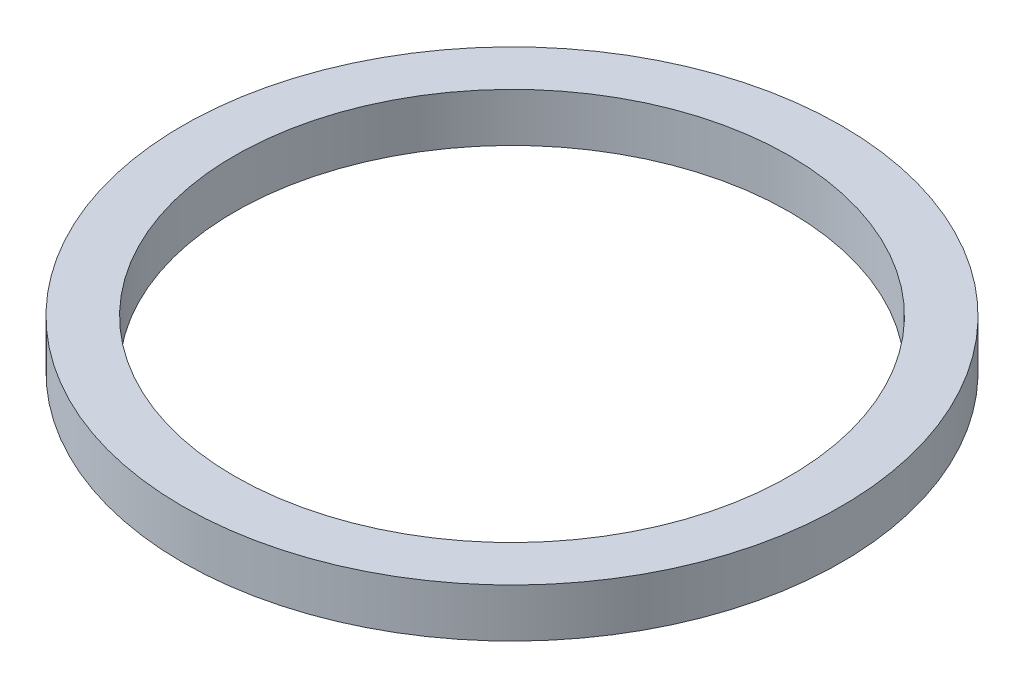
ISO-10303-21;
HEADER;
FILE_DESCRIPTION(('STEP AP214'),'2;1');
FILE_NAME('part.step','',(''),(''),'','','');
FILE_SCHEMA(('AUTOMOTIVE_DESIGN { 1 0 10303 214 1 1 1 1 }'));
ENDSEC;
DATA;
#1=APPLICATION_CONTEXT('core data for automotive mechanical design processes');
#2=APPLICATION_PROTOCOL_DEFINITION('international standard','automotive_design',2000,#1);
#3=PRODUCT_CONTEXT('',#1,'mechanical');
#4=PRODUCT('Part','Part','',(#3));
#5=PRODUCT_RELATED_PRODUCT_CATEGORY('part','',(#4));
#6=PRODUCT_DEFINITION_FORMATION('','',#4);
#7=PRODUCT_DEFINITION_CONTEXT('part definition',#1,'design');
#8=PRODUCT_DEFINITION('design','',#6,#7);
#9=PRODUCT_DEFINITION_SHAPE('','',#8);
#10=(LENGTH_UNIT() NAMED_UNIT(*) SI_UNIT(.MILLI.,.METRE.));
#11=(NAMED_UNIT(*) PLANE_ANGLE_UNIT() SI_UNIT($,.RADIAN.));
#12=(NAMED_UNIT(*) SI_UNIT($,.STERADIAN.) SOLID_ANGLE_UNIT());
#13=UNCERTAINTY_MEASURE_WITH_UNIT(LENGTH_MEASURE(1.E-05),#10,'distance_accuracy_value','');
#14=(GEOMETRIC_REPRESENTATION_CONTEXT(3) GLOBAL_UNCERTAINTY_ASSIGNED_CONTEXT((#13)) GLOBAL_UNIT_ASSIGNED_CONTEXT((#10,
#11,#12)) REPRESENTATION_CONTEXT('',''));
#15=CARTESIAN_POINT('',(0.,0.,0.));
#16=DIRECTION('',(0.,0.,1.));
#17=DIRECTION('',(1.,0.,0.));
#18=AXIS2_PLACEMENT_3D('',#15,#16,#17);
#19=CARTESIAN_POINT('',(0.,7.,0.));
#20=DIRECTION('',(0.,-1.,0.));
#21=DIRECTION('',(0.,0.,-1.));
#22=AXIS2_PLACEMENT_3D('',#19,#20,#21);
#23=CYLINDRICAL_SURFACE('',#22,47.5);
#24=CARTESIAN_POINT('',(0.,7.,0.));
#25=DIRECTION('',(0.,1.,0.));
#26=DIRECTION('',(0.,0.,1.));
#27=AXIS2_PLACEMENT_3D('',#24,#25,#26);
#28=CIRCLE('',#27,47.5);
#29=CARTESIAN_POINT('',(0.,7.,47.5));
#30=VERTEX_POINT('',#29);
#31=EDGE_CURVE('E10',#30,#30,#28,.T.);
#32=ORIENTED_EDGE('',*,*,#31,.F.);
#33=EDGE_LOOP('',(#32));
#34=FACE_BOUND('',#33,.T.);
#35=CARTESIAN_POINT('',(0.,0.,0.));
#36=DIRECTION('',(0.,1.,0.));
#37=DIRECTION('',(0.,0.,1.));
#38=AXIS2_PLACEMENT_3D('',#35,#36,#37);
#39=CIRCLE('',#38,47.5);
#40=CARTESIAN_POINT('',(0.,0.,47.5));
#41=VERTEX_POINT('',#40);
#42=EDGE_CURVE('E37',#41,#41,#39,.T.);
#43=ORIENTED_EDGE('',*,*,#42,.T.);
#44=EDGE_LOOP('',(#43));
#45=FACE_BOUND('',#44,.T.);
#46=ADVANCED_FACE('F40',(#34,#45),#23,.T.);
#47=CARTESIAN_POINT('',(0.,7.,0.));
#48=DIRECTION('',(0.,1.,0.));
#49=DIRECTION('',(0.,0.,1.));
#50=AXIS2_PLACEMENT_3D('',#47,#48,#49);
#51=PLANE('',#50);
#52=CARTESIAN_POINT('',(0.,7.,0.));
#53=DIRECTION('',(0.,1.,0.));
#54=DIRECTION('',(0.,0.,1.));
#55=AXIS2_PLACEMENT_3D('',#52,#53,#54);
#56=CIRCLE('',#55,40.);
#57=CARTESIAN_POINT('',(0.,7.,40.));
#58=VERTEX_POINT('',#57);
#59=EDGE_CURVE('E50',#58,#58,#56,.T.);
#60=ORIENTED_EDGE('',*,*,#59,.F.);
#61=EDGE_LOOP('',(#60));
#62=FACE_BOUND('',#61,.T.);
#63=ORIENTED_EDGE('',*,*,#31,.T.);
#64=EDGE_LOOP('',(#63));
#65=FACE_BOUND('',#64,.T.);
#66=ADVANCED_FACE('F59',(#62,#65),#51,.T.);
#67=CARTESIAN_POINT('',(0.,0.,0.));
#68=DIRECTION('',(0.,1.,0.));
#69=DIRECTION('',(0.,0.,1.));
#70=AXIS2_PLACEMENT_3D('',#67,#68,#69);
#71=PLANE('',#70);
#72=CARTESIAN_POINT('',(0.,0.,0.));
#73=DIRECTION('',(0.,1.,0.));
#74=DIRECTION('',(0.,0.,1.));
#75=AXIS2_PLACEMENT_3D('',#72,#73,#74);
#76=CIRCLE('',#75,40.);
#77=CARTESIAN_POINT('',(0.,0.,40.));
#78=VERTEX_POINT('',#77);
#79=EDGE_CURVE('E47',#78,#78,#76,.T.);
#80=ORIENTED_EDGE('',*,*,#79,.T.);
#81=EDGE_LOOP('',(#80));
#82=FACE_BOUND('',#81,.T.);
#83=ORIENTED_EDGE('',*,*,#42,.F.);
#84=EDGE_LOOP('',(#83));
#85=FACE_BOUND('',#84,.T.);
#86=ADVANCED_FACE('F58',(#82,#85),#71,.F.);
#87=CARTESIAN_POINT('',(0.,7.,0.));
#88=DIRECTION('',(0.,-1.,0.));
#89=DIRECTION('',(0.,0.,-1.));
#90=AXIS2_PLACEMENT_3D('',#87,#88,#89);
#91=CYLINDRICAL_SURFACE('',#90,40.);
#92=ORIENTED_EDGE('',*,*,#59,.T.);
#93=EDGE_LOOP('',(#92));
#94=FACE_BOUND('',#93,.T.);
#95=ORIENTED_EDGE('',*,*,#79,.F.);
#96=EDGE_LOOP('',(#95));
#97=FACE_BOUND('',#96,.T.);
#98=ADVANCED_FACE('F54',(#94,#97),#91,.F.);
#99=CLOSED_SHELL('',(#46,#66,#86,#98));
#100=MANIFOLD_SOLID_BREP('B2',#99);
#101=ADVANCED_BREP_SHAPE_REPRESENTATION('',(#18,#100),#14);
#102=SHAPE_DEFINITION_REPRESENTATION(#9,#101);
ENDSEC;
END-ISO-10303-21;
